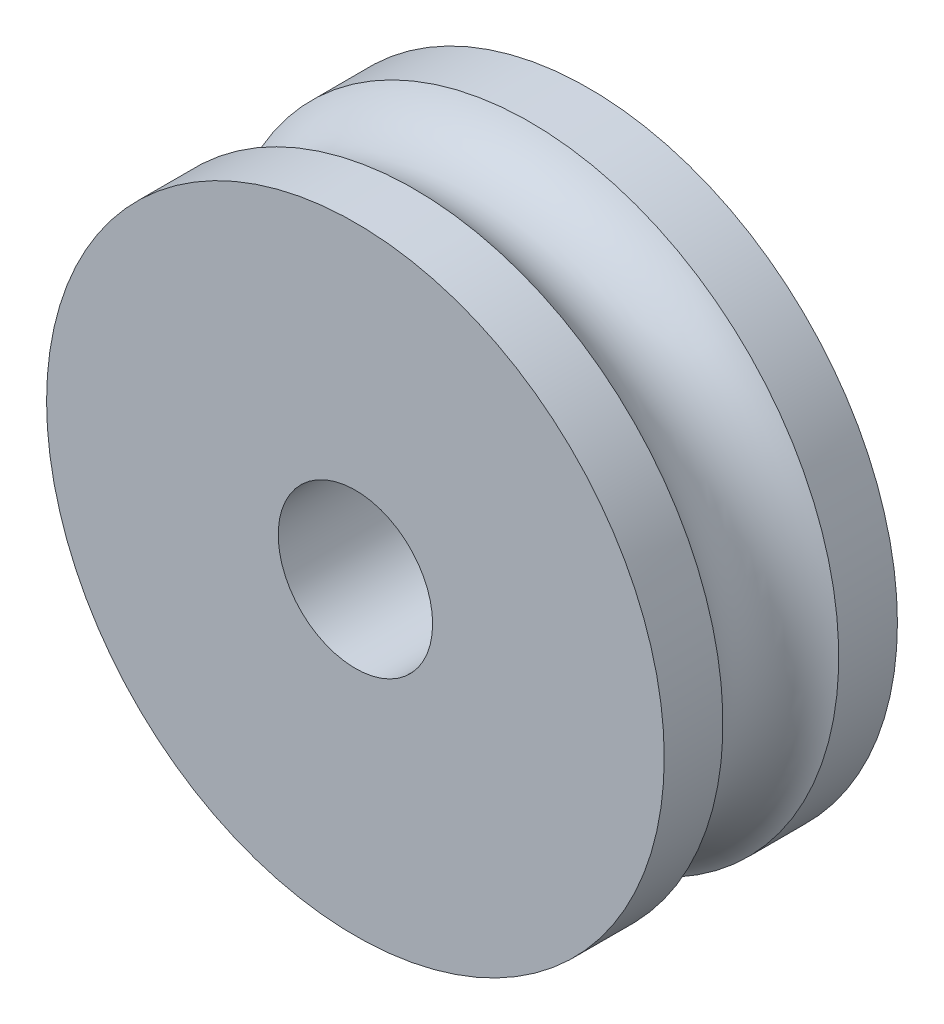
ISO-10303-21;
HEADER;
FILE_DESCRIPTION(('STEP AP214'),'2;1');
FILE_NAME('part.step','',(''),(''),'','','');
FILE_SCHEMA(('AUTOMOTIVE_DESIGN { 1 0 10303 214 1 1 1 1 }'));
ENDSEC;
DATA;
#1=APPLICATION_CONTEXT('core data for automotive mechanical design processes');
#2=APPLICATION_PROTOCOL_DEFINITION('international standard','automotive_design',2000,#1);
#3=PRODUCT_CONTEXT('',#1,'mechanical');
#4=PRODUCT('Part','Part','',(#3));
#5=PRODUCT_RELATED_PRODUCT_CATEGORY('part','',(#4));
#6=PRODUCT_DEFINITION_FORMATION('','',#4);
#7=PRODUCT_DEFINITION_CONTEXT('part definition',#1,'design');
#8=PRODUCT_DEFINITION('design','',#6,#7);
#9=PRODUCT_DEFINITION_SHAPE('','',#8);
#10=(LENGTH_UNIT() NAMED_UNIT(*) SI_UNIT(.MILLI.,.METRE.));
#11=(NAMED_UNIT(*) PLANE_ANGLE_UNIT() SI_UNIT($,.RADIAN.));
#12=(NAMED_UNIT(*) SI_UNIT($,.STERADIAN.) SOLID_ANGLE_UNIT());
#13=UNCERTAINTY_MEASURE_WITH_UNIT(LENGTH_MEASURE(1.E-05),#10,'distance_accuracy_value','');
#14=(GEOMETRIC_REPRESENTATION_CONTEXT(3) GLOBAL_UNCERTAINTY_ASSIGNED_CONTEXT((#13)) GLOBAL_UNIT_ASSIGNED_CONTEXT((#10,
#11,#12)) REPRESENTATION_CONTEXT('',''));
#15=CARTESIAN_POINT('',(0.,0.,0.));
#16=DIRECTION('',(0.,0.,1.));
#17=DIRECTION('',(1.,0.,0.));
#18=AXIS2_PLACEMENT_3D('',#15,#16,#17);
#19=CARTESIAN_POINT('',(0.,0.,9.5885));
#20=DIRECTION('',(0.,0.,-1.));
#21=DIRECTION('',(-1.,0.,0.));
#22=AXIS2_PLACEMENT_3D('',#19,#20,#21);
#23=CYLINDRICAL_SURFACE('',#22,12.7);
#24=CARTESIAN_POINT('',(0.,0.,2.413));
#25=DIRECTION('',(0.,0.,-1.));
#26=DIRECTION('',(-1.,0.,0.));
#27=AXIS2_PLACEMENT_3D('',#24,#25,#26);
#28=CIRCLE('',#27,12.7);
#29=CARTESIAN_POINT('',(-12.7,0.,2.413));
#30=VERTEX_POINT('',#29);
#31=EDGE_CURVE('E54',#30,#30,#28,.T.);
#32=ORIENTED_EDGE('',*,*,#31,.T.);
#33=EDGE_LOOP('',(#32));
#34=FACE_BOUND('',#33,.T.);
#35=CARTESIAN_POINT('',(0.,0.,0.));
#36=DIRECTION('',(0.,0.,1.));
#37=DIRECTION('',(1.,0.,0.));
#38=AXIS2_PLACEMENT_3D('',#35,#36,#37);
#39=CIRCLE('',#38,12.7);
#40=CARTESIAN_POINT('',(12.7,0.,0.));
#41=VERTEX_POINT('',#40);
#42=EDGE_CURVE('E37',#41,#41,#39,.T.);
#43=ORIENTED_EDGE('',*,*,#42,.T.);
#44=EDGE_LOOP('',(#43));
#45=FACE_BOUND('',#44,.T.);
#46=ADVANCED_FACE('F33',(#34,#45),#23,.T.);
#47=CARTESIAN_POINT('',(0.,0.,9.5885));
#48=DIRECTION('',(0.,0.,1.));
#49=DIRECTION('',(1.,0.,0.));
#50=AXIS2_PLACEMENT_3D('',#47,#48,#49);
#51=PLANE('',#50);
#52=CARTESIAN_POINT('',(0.,0.,9.5885));
#53=DIRECTION('',(0.,0.,1.));
#54=DIRECTION('',(1.,0.,0.));
#55=AXIS2_PLACEMENT_3D('',#52,#53,#54);
#56=CIRCLE('',#55,12.7);
#57=CARTESIAN_POINT('',(12.7,0.,9.5885));
#58=VERTEX_POINT('',#57);
#59=EDGE_CURVE('E10',#58,#58,#56,.T.);
#60=ORIENTED_EDGE('',*,*,#59,.T.);
#61=EDGE_LOOP('',(#60));
#62=FACE_BOUND('',#61,.T.);
#63=CARTESIAN_POINT('',(0.,0.,9.5885));
#64=DIRECTION('',(0.,0.,1.));
#65=DIRECTION('',(1.,0.,0.));
#66=AXIS2_PLACEMENT_3D('',#63,#64,#65);
#67=CIRCLE('',#66,3.175);
#68=CARTESIAN_POINT('',(3.175,0.,9.5885));
#69=VERTEX_POINT('',#68);
#70=EDGE_CURVE('E44',#69,#69,#67,.T.);
#71=ORIENTED_EDGE('',*,*,#70,.F.);
#72=EDGE_LOOP('',(#71));
#73=FACE_BOUND('',#72,.T.);
#74=ADVANCED_FACE('F76',(#62,#73),#51,.T.);
#75=CARTESIAN_POINT('',(0.,0.,0.));
#76=DIRECTION('',(0.,0.,1.));
#77=DIRECTION('',(1.,0.,0.));
#78=AXIS2_PLACEMENT_3D('',#75,#76,#77);
#79=PLANE('',#78);
#80=ORIENTED_EDGE('',*,*,#42,.F.);
#81=EDGE_LOOP('',(#80));
#82=FACE_BOUND('',#81,.T.);
#83=CARTESIAN_POINT('',(0.,0.,0.));
#84=DIRECTION('',(0.,0.,1.));
#85=DIRECTION('',(1.,0.,0.));
#86=AXIS2_PLACEMENT_3D('',#83,#84,#85);
#87=CIRCLE('',#86,3.175);
#88=CARTESIAN_POINT('',(3.175,0.,0.));
#89=VERTEX_POINT('',#88);
#90=EDGE_CURVE('E46',#89,#89,#87,.T.);
#91=ORIENTED_EDGE('',*,*,#90,.T.);
#92=EDGE_LOOP('',(#91));
#93=FACE_BOUND('',#92,.T.);
#94=ADVANCED_FACE('F69',(#82,#93),#79,.F.);
#95=CARTESIAN_POINT('',(0.,0.,7.1755));
#96=DIRECTION('',(0.,0.,-1.));
#97=DIRECTION('',(-1.,0.,0.));
#98=AXIS2_PLACEMENT_3D('',#95,#96,#97);
#99=CIRCLE('',#98,12.7);
#100=CARTESIAN_POINT('',(-12.7,0.,7.1755));
#101=VERTEX_POINT('',#100);
#102=EDGE_CURVE('E49',#101,#101,#99,.T.);
#103=ORIENTED_EDGE('',*,*,#102,.F.);
#104=EDGE_LOOP('',(#103));
#105=FACE_BOUND('',#104,.T.);
#106=ORIENTED_EDGE('',*,*,#59,.F.);
#107=EDGE_LOOP('',(#106));
#108=FACE_BOUND('',#107,.T.);
#109=ADVANCED_FACE('F35',(#105,#108),#23,.T.);
#110=CARTESIAN_POINT('',(0.,0.,9.5885));
#111=DIRECTION('',(0.,0.,-1.));
#112=DIRECTION('',(-1.,0.,0.));
#113=AXIS2_PLACEMENT_3D('',#110,#111,#112);
#114=CYLINDRICAL_SURFACE('',#113,3.175);
#115=ORIENTED_EDGE('',*,*,#70,.T.);
#116=EDGE_LOOP('',(#115));
#117=FACE_BOUND('',#116,.T.);
#118=ORIENTED_EDGE('',*,*,#90,.F.);
#119=EDGE_LOOP('',(#118));
#120=FACE_BOUND('',#119,.T.);
#121=ADVANCED_FACE('F63',(#117,#120),#114,.F.);
#122=CARTESIAN_POINT('',(0.,0.,4.79425));
#123=DIRECTION('',(0.,0.,-1.));
#124=DIRECTION('',(-1.,0.,0.));
#125=AXIS2_PLACEMENT_3D('',#122,#123,#124);
#126=TOROIDAL_SURFACE('',#125,14.0086906907216,2.71717185442535);
#127=ORIENTED_EDGE('',*,*,#31,.F.);
#128=EDGE_LOOP('',(#127));
#129=FACE_BOUND('',#128,.T.);
#130=ORIENTED_EDGE('',*,*,#102,.T.);
#131=EDGE_LOOP('',(#130));
#132=FACE_BOUND('',#131,.T.);
#133=ADVANCED_FACE('F60',(#129,#132),#126,.F.);
#134=CLOSED_SHELL('',(#46,#74,#94,#109,#121,#133));
#135=MANIFOLD_SOLID_BREP('B2',#134);
#136=ADVANCED_BREP_SHAPE_REPRESENTATION('',(#18,#135),#14);
#137=SHAPE_DEFINITION_REPRESENTATION(#9,#136);
ENDSEC;
END-ISO-10303-21;
